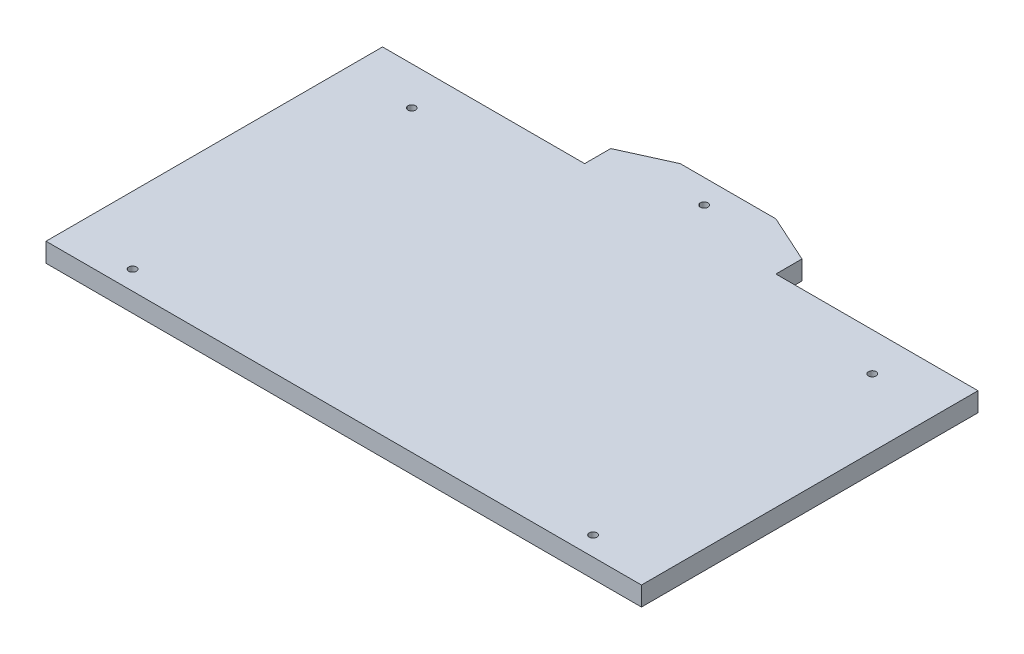
ISO-10303-21;
HEADER;
FILE_DESCRIPTION(('STEP AP214'),'2;1');
FILE_NAME('part.step','',(''),(''),'','','');
FILE_SCHEMA(('AUTOMOTIVE_DESIGN { 1 0 10303 214 1 1 1 1 }'));
ENDSEC;
DATA;
#1=APPLICATION_CONTEXT('core data for automotive mechanical design processes');
#2=APPLICATION_PROTOCOL_DEFINITION('international standard','automotive_design',2000,#1);
#3=PRODUCT_CONTEXT('',#1,'mechanical');
#4=PRODUCT('Part','Part','',(#3));
#5=PRODUCT_RELATED_PRODUCT_CATEGORY('part','',(#4));
#6=PRODUCT_DEFINITION_FORMATION('','',#4);
#7=PRODUCT_DEFINITION_CONTEXT('part definition',#1,'design');
#8=PRODUCT_DEFINITION('design','',#6,#7);
#9=PRODUCT_DEFINITION_SHAPE('','',#8);
#10=(LENGTH_UNIT() NAMED_UNIT(*) SI_UNIT(.MILLI.,.METRE.));
#11=(NAMED_UNIT(*) PLANE_ANGLE_UNIT() SI_UNIT($,.RADIAN.));
#12=(NAMED_UNIT(*) SI_UNIT($,.STERADIAN.) SOLID_ANGLE_UNIT());
#13=UNCERTAINTY_MEASURE_WITH_UNIT(LENGTH_MEASURE(1.E-05),#10,'distance_accuracy_value','');
#14=(GEOMETRIC_REPRESENTATION_CONTEXT(3) GLOBAL_UNCERTAINTY_ASSIGNED_CONTEXT((#13)) GLOBAL_UNIT_ASSIGNED_CONTEXT((#10,
#11,#12)) REPRESENTATION_CONTEXT('',''));
#15=CARTESIAN_POINT('',(0.,0.,0.));
#16=DIRECTION('',(0.,0.,1.));
#17=DIRECTION('',(1.,0.,0.));
#18=AXIS2_PLACEMENT_3D('',#15,#16,#17);
#19=CARTESIAN_POINT('',(0.,5.,-44.));
#20=DIRECTION('',(0.,0.,1.));
#21=DIRECTION('',(1.,0.,0.));
#22=AXIS2_PLACEMENT_3D('',#19,#20,#21);
#23=PLANE('',#22);
#24=DIRECTION('',(0.,1.,0.));
#25=VECTOR('',#24,1.);
#26=CARTESIAN_POINT('',(-23.8283042472908,-51.537589944117,-44.));
#27=LINE('',#26,#25);
#28=CARTESIAN_POINT('',(-23.8283042472908,0.,-44.));
#29=VERTEX_POINT('',#28);
#30=CARTESIAN_POINT('',(-23.8283042472908,5.,-44.));
#31=VERTEX_POINT('',#30);
#32=EDGE_CURVE('E74',#29,#31,#27,.T.);
#33=ORIENTED_EDGE('',*,*,#32,.F.);
#34=DIRECTION('',(-1.,0.,0.));
#35=VECTOR('',#34,1.);
#36=CARTESIAN_POINT('',(0.,0.,-44.));
#37=LINE('',#36,#35);
#38=CARTESIAN_POINT('',(-76.6797078460986,0.,-44.));
#39=VERTEX_POINT('',#38);
#40=EDGE_CURVE('E212',#29,#39,#37,.T.);
#41=ORIENTED_EDGE('',*,*,#40,.T.);
#42=DIRECTION('',(0.,-1.,0.));
#43=VECTOR('',#42,1.);
#44=CARTESIAN_POINT('',(-76.6797078460986,5.,-44.));
#45=LINE('',#44,#43);
#46=CARTESIAN_POINT('',(-76.6797078460986,5.,-44.));
#47=VERTEX_POINT('',#46);
#48=EDGE_CURVE('E59',#47,#39,#45,.T.);
#49=ORIENTED_EDGE('',*,*,#48,.F.);
#50=DIRECTION('',(-1.,0.,0.));
#51=VECTOR('',#50,1.);
#52=CARTESIAN_POINT('',(0.,5.,-44.));
#53=LINE('',#52,#51);
#54=EDGE_CURVE('E198',#31,#47,#53,.T.);
#55=ORIENTED_EDGE('',*,*,#54,.F.);
#56=EDGE_LOOP('',(#33,#41,#49,#55));
#57=FACE_BOUND('',#56,.T.);
#58=ADVANCED_FACE('F50',(#57),#23,.F.);
#59=CARTESIAN_POINT('',(79.023099351517,5.,0.));
#60=DIRECTION('',(1.,0.,0.));
#61=DIRECTION('',(0.,0.,-1.));
#62=AXIS2_PLACEMENT_3D('',#59,#60,#61);
#63=PLANE('',#62);
#64=DIRECTION('',(0.,0.,1.));
#65=VECTOR('',#64,1.);
#66=CARTESIAN_POINT('',(79.023099351517,0.,0.));
#67=LINE('',#66,#65);
#68=CARTESIAN_POINT('',(79.023099351517,0.,-44.));
#69=VERTEX_POINT('',#68);
#70=CARTESIAN_POINT('',(79.023099351517,0.,44.));
#71=VERTEX_POINT('',#70);
#72=EDGE_CURVE('E192',#69,#71,#67,.T.);
#73=ORIENTED_EDGE('',*,*,#72,.F.);
#74=DIRECTION('',(0.,-1.,0.));
#75=VECTOR('',#74,1.);
#76=CARTESIAN_POINT('',(79.023099351517,5.,-44.));
#77=LINE('',#76,#75);
#78=CARTESIAN_POINT('',(79.023099351517,5.,-44.));
#79=VERTEX_POINT('',#78);
#80=EDGE_CURVE('E11',#79,#69,#77,.T.);
#81=ORIENTED_EDGE('',*,*,#80,.F.);
#82=DIRECTION('',(0.,0.,1.));
#83=VECTOR('',#82,1.);
#84=CARTESIAN_POINT('',(79.023099351517,5.,0.));
#85=LINE('',#84,#83);
#86=CARTESIAN_POINT('',(79.023099351517,5.,44.));
#87=VERTEX_POINT('',#86);
#88=EDGE_CURVE('E194',#79,#87,#85,.T.);
#89=ORIENTED_EDGE('',*,*,#88,.T.);
#90=DIRECTION('',(0.,-1.,0.));
#91=VECTOR('',#90,1.);
#92=CARTESIAN_POINT('',(79.023099351517,5.,44.));
#93=LINE('',#92,#91);
#94=EDGE_CURVE('E208',#87,#71,#93,.T.);
#95=ORIENTED_EDGE('',*,*,#94,.T.);
#96=EDGE_LOOP('',(#73,#81,#89,#95));
#97=FACE_BOUND('',#96,.T.);
#98=ADVANCED_FACE('F52',(#97),#63,.T.);
#99=CARTESIAN_POINT('',(26.1716957527092,0.,-44.));
#100=VERTEX_POINT('',#99);
#101=EDGE_CURVE('E213',#69,#100,#37,.T.);
#102=ORIENTED_EDGE('',*,*,#101,.T.);
#103=DIRECTION('',(0.,1.,0.));
#104=VECTOR('',#103,1.);
#105=CARTESIAN_POINT('',(26.1716957527092,-51.537589944117,-44.));
#106=LINE('',#105,#104);
#107=CARTESIAN_POINT('',(26.1716957527092,5.,-44.));
#108=VERTEX_POINT('',#107);
#109=EDGE_CURVE('E66',#100,#108,#106,.T.);
#110=ORIENTED_EDGE('',*,*,#109,.T.);
#111=EDGE_CURVE('E155',#79,#108,#53,.T.);
#112=ORIENTED_EDGE('',*,*,#111,.F.);
#113=ORIENTED_EDGE('',*,*,#80,.T.);
#114=EDGE_LOOP('',(#102,#110,#112,#113));
#115=FACE_BOUND('',#114,.T.);
#116=ADVANCED_FACE('F332',(#115),#23,.F.);
#117=CARTESIAN_POINT('',(-76.6797078460986,5.,0.));
#118=DIRECTION('',(1.,0.,0.));
#119=DIRECTION('',(0.,0.,-1.));
#120=AXIS2_PLACEMENT_3D('',#117,#118,#119);
#121=PLANE('',#120);
#122=DIRECTION('',(0.,0.,1.));
#123=VECTOR('',#122,1.);
#124=CARTESIAN_POINT('',(-76.6797078460986,0.,0.));
#125=LINE('',#124,#123);
#126=CARTESIAN_POINT('',(-76.6797078460986,0.,44.));
#127=VERTEX_POINT('',#126);
#128=EDGE_CURVE('E216',#39,#127,#125,.T.);
#129=ORIENTED_EDGE('',*,*,#128,.T.);
#130=DIRECTION('',(0.,-1.,0.));
#131=VECTOR('',#130,1.);
#132=CARTESIAN_POINT('',(-76.6797078460986,5.,44.));
#133=LINE('',#132,#131);
#134=CARTESIAN_POINT('',(-76.6797078460986,5.,44.));
#135=VERTEX_POINT('',#134);
#136=EDGE_CURVE('E224',#135,#127,#133,.T.);
#137=ORIENTED_EDGE('',*,*,#136,.F.);
#138=DIRECTION('',(0.,0.,1.));
#139=VECTOR('',#138,1.);
#140=CARTESIAN_POINT('',(-76.6797078460986,5.,0.));
#141=LINE('',#140,#139);
#142=EDGE_CURVE('E202',#47,#135,#141,.T.);
#143=ORIENTED_EDGE('',*,*,#142,.F.);
#144=ORIENTED_EDGE('',*,*,#48,.T.);
#145=EDGE_LOOP('',(#129,#137,#143,#144));
#146=FACE_BOUND('',#145,.T.);
#147=ADVANCED_FACE('F234',(#146),#121,.F.);
#148=CARTESIAN_POINT('',(0.,5.,44.));
#149=DIRECTION('',(0.,0.,-1.));
#150=DIRECTION('',(-1.,0.,0.));
#151=AXIS2_PLACEMENT_3D('',#148,#149,#150);
#152=PLANE('',#151);
#153=DIRECTION('',(1.,0.,0.));
#154=VECTOR('',#153,1.);
#155=CARTESIAN_POINT('',(0.,0.,44.));
#156=LINE('',#155,#154);
#157=EDGE_CURVE('E199',#127,#71,#156,.T.);
#158=ORIENTED_EDGE('',*,*,#157,.T.);
#159=ORIENTED_EDGE('',*,*,#94,.F.);
#160=DIRECTION('',(1.,0.,0.));
#161=VECTOR('',#160,1.);
#162=CARTESIAN_POINT('',(0.,5.,44.));
#163=LINE('',#162,#161);
#164=EDGE_CURVE('E205',#135,#87,#163,.T.);
#165=ORIENTED_EDGE('',*,*,#164,.F.);
#166=ORIENTED_EDGE('',*,*,#136,.T.);
#167=EDGE_LOOP('',(#158,#159,#165,#166));
#168=FACE_BOUND('',#167,.T.);
#169=ADVANCED_FACE('F245',(#168),#152,.F.);
#170=CARTESIAN_POINT('',(0.,5.,0.));
#171=DIRECTION('',(0.,1.,0.));
#172=DIRECTION('',(0.,0.,1.));
#173=AXIS2_PLACEMENT_3D('',#170,#171,#172);
#174=PLANE('',#173);
#175=ORIENTED_EDGE('',*,*,#88,.F.);
#176=ORIENTED_EDGE('',*,*,#111,.T.);
#177=DIRECTION('',(0.,0.,-1.));
#178=VECTOR('',#177,1.);
#179=CARTESIAN_POINT('',(26.1716957527092,5.,-44.));
#180=LINE('',#179,#178);
#181=CARTESIAN_POINT('',(26.1716957527092,5.,-50.823606938333));
#182=VERTEX_POINT('',#181);
#183=EDGE_CURVE('E133',#108,#182,#180,.T.);
#184=ORIENTED_EDGE('',*,*,#183,.T.);
#185=DIRECTION('',(-0.910654396943775,0.,-0.413168935578379));
#186=VECTOR('',#185,1.);
#187=CARTESIAN_POINT('',(26.1716957527092,5.,-50.823606938333));
#188=LINE('',#187,#186);
#189=CARTESIAN_POINT('',(13.6716957527092,5.,-56.4949260601234));
#190=VERTEX_POINT('',#189);
#191=EDGE_CURVE('E143',#182,#190,#188,.T.);
#192=ORIENTED_EDGE('',*,*,#191,.T.);
#193=DIRECTION('',(-1.,0.,0.));
#194=VECTOR('',#193,1.);
#195=CARTESIAN_POINT('',(13.6716957527092,5.,-56.4949260601234));
#196=LINE('',#195,#194);
#197=CARTESIAN_POINT('',(-11.3283042472908,5.,-56.4949260601235));
#198=VERTEX_POINT('',#197);
#199=EDGE_CURVE('E150',#190,#198,#196,.T.);
#200=ORIENTED_EDGE('',*,*,#199,.T.);
#201=DIRECTION('',(-0.910654396943774,0.,0.41316893557838));
#202=VECTOR('',#201,1.);
#203=CARTESIAN_POINT('',(-11.3283042472908,5.,-56.4949260601235));
#204=LINE('',#203,#202);
#205=CARTESIAN_POINT('',(-23.8283042472908,5.,-50.823606938333));
#206=VERTEX_POINT('',#205);
#207=EDGE_CURVE('E168',#198,#206,#204,.T.);
#208=ORIENTED_EDGE('',*,*,#207,.T.);
#209=DIRECTION('',(0.,0.,1.));
#210=VECTOR('',#209,1.);
#211=CARTESIAN_POINT('',(-23.8283042472908,5.,-50.823606938333));
#212=LINE('',#211,#210);
#213=EDGE_CURVE('E140',#206,#31,#212,.T.);
#214=ORIENTED_EDGE('',*,*,#213,.T.);
#215=ORIENTED_EDGE('',*,*,#54,.T.);
#216=ORIENTED_EDGE('',*,*,#142,.T.);
#217=ORIENTED_EDGE('',*,*,#164,.T.);
#218=EDGE_LOOP('',(#175,#176,#184,#192,#200,#208,#214,#215,#216,#217));
#219=FACE_BOUND('',#218,.T.);
#220=CARTESIAN_POINT('',(1.17169575270918,5.,-50.2474630300617));
#221=DIRECTION('',(0.,1.,0.));
#222=DIRECTION('',(0.,0.,1.));
#223=AXIS2_PLACEMENT_3D('',#220,#221,#222);
#224=CIRCLE('',#223,1.);
#225=CARTESIAN_POINT('',(1.17169575270918,5.,-49.2474630300617));
#226=VERTEX_POINT('',#225);
#227=EDGE_CURVE('E157',#226,#226,#224,.T.);
#228=ORIENTED_EDGE('',*,*,#227,.F.);
#229=EDGE_LOOP('',(#228));
#230=FACE_BOUND('',#229,.T.);
#231=CARTESIAN_POINT('',(61.3854570382798,5.,-34.));
#232=DIRECTION('',(0.,1.,0.));
#233=DIRECTION('',(0.,0.,1.));
#234=AXIS2_PLACEMENT_3D('',#231,#232,#233);
#235=CIRCLE('',#234,1.);
#236=CARTESIAN_POINT('',(61.3854570382798,5.,-33.));
#237=VERTEX_POINT('',#236);
#238=EDGE_CURVE('E290',#237,#237,#235,.T.);
#239=ORIENTED_EDGE('',*,*,#238,.F.);
#240=EDGE_LOOP('',(#239));
#241=FACE_BOUND('',#240,.T.);
#242=CARTESIAN_POINT('',(61.3854570382798,5.,39.));
#243=DIRECTION('',(0.,1.,0.));
#244=DIRECTION('',(0.,0.,1.));
#245=AXIS2_PLACEMENT_3D('',#242,#243,#244);
#246=CIRCLE('',#245,1.);
#247=CARTESIAN_POINT('',(61.3854570382798,5.,40.));
#248=VERTEX_POINT('',#247);
#249=EDGE_CURVE('E298',#248,#248,#246,.T.);
#250=ORIENTED_EDGE('',*,*,#249,.F.);
#251=EDGE_LOOP('',(#250));
#252=FACE_BOUND('',#251,.T.);
#253=CARTESIAN_POINT('',(-59.0420655328614,5.,39.));
#254=DIRECTION('',(0.,1.,0.));
#255=DIRECTION('',(0.,0.,1.));
#256=AXIS2_PLACEMENT_3D('',#253,#254,#255);
#257=CIRCLE('',#256,0.999999999999994);
#258=CARTESIAN_POINT('',(-59.0420655328614,5.,40.));
#259=VERTEX_POINT('',#258);
#260=EDGE_CURVE('E306',#259,#259,#257,.T.);
#261=ORIENTED_EDGE('',*,*,#260,.F.);
#262=EDGE_LOOP('',(#261));
#263=FACE_BOUND('',#262,.T.);
#264=CARTESIAN_POINT('',(-59.0420655328614,5.,-34.));
#265=DIRECTION('',(0.,1.,0.));
#266=DIRECTION('',(0.,0.,1.));
#267=AXIS2_PLACEMENT_3D('',#264,#265,#266);
#268=CIRCLE('',#267,0.999999999999994);
#269=CARTESIAN_POINT('',(-59.0420655328614,5.,-33.));
#270=VERTEX_POINT('',#269);
#271=EDGE_CURVE('E314',#270,#270,#268,.T.);
#272=ORIENTED_EDGE('',*,*,#271,.F.);
#273=EDGE_LOOP('',(#272));
#274=FACE_BOUND('',#273,.T.);
#275=ADVANCED_FACE('F153',(#219,#230,#241,#252,#263,#274),#174,.T.);
#276=CARTESIAN_POINT('',(0.,0.,0.));
#277=DIRECTION('',(0.,1.,0.));
#278=DIRECTION('',(0.,0.,1.));
#279=AXIS2_PLACEMENT_3D('',#276,#277,#278);
#280=PLANE('',#279);
#281=ORIENTED_EDGE('',*,*,#72,.T.);
#282=ORIENTED_EDGE('',*,*,#157,.F.);
#283=ORIENTED_EDGE('',*,*,#128,.F.);
#284=ORIENTED_EDGE('',*,*,#40,.F.);
#285=DIRECTION('',(0.,0.,-1.));
#286=VECTOR('',#285,1.);
#287=CARTESIAN_POINT('',(-23.8283042472908,0.,-50.823606938333));
#288=LINE('',#287,#286);
#289=CARTESIAN_POINT('',(-23.8283042472908,0.,-50.823606938333));
#290=VERTEX_POINT('',#289);
#291=EDGE_CURVE('E265',#29,#290,#288,.T.);
#292=ORIENTED_EDGE('',*,*,#291,.T.);
#293=DIRECTION('',(0.910654396943774,0.,-0.41316893557838));
#294=VECTOR('',#293,1.);
#295=CARTESIAN_POINT('',(-11.3283042472908,0.,-56.4949260601235));
#296=LINE('',#295,#294);
#297=CARTESIAN_POINT('',(-11.3283042472908,0.,-56.4949260601235));
#298=VERTEX_POINT('',#297);
#299=EDGE_CURVE('E268',#290,#298,#296,.T.);
#300=ORIENTED_EDGE('',*,*,#299,.T.);
#301=DIRECTION('',(1.,0.,0.));
#302=VECTOR('',#301,1.);
#303=CARTESIAN_POINT('',(13.6716957527092,0.,-56.4949260601234));
#304=LINE('',#303,#302);
#305=CARTESIAN_POINT('',(13.6716957527092,0.,-56.4949260601234));
#306=VERTEX_POINT('',#305);
#307=EDGE_CURVE('E177',#298,#306,#304,.T.);
#308=ORIENTED_EDGE('',*,*,#307,.T.);
#309=DIRECTION('',(0.910654396943775,0.,0.413168935578379));
#310=VECTOR('',#309,1.);
#311=CARTESIAN_POINT('',(26.1716957527092,0.,-50.823606938333));
#312=LINE('',#311,#310);
#313=CARTESIAN_POINT('',(26.1716957527092,0.,-50.823606938333));
#314=VERTEX_POINT('',#313);
#315=EDGE_CURVE('E193',#306,#314,#312,.T.);
#316=ORIENTED_EDGE('',*,*,#315,.T.);
#317=DIRECTION('',(0.,0.,1.));
#318=VECTOR('',#317,1.);
#319=CARTESIAN_POINT('',(26.1716957527092,0.,-44.));
#320=LINE('',#319,#318);
#321=EDGE_CURVE('E135',#314,#100,#320,.T.);
#322=ORIENTED_EDGE('',*,*,#321,.T.);
#323=ORIENTED_EDGE('',*,*,#101,.F.);
#324=EDGE_LOOP('',(#281,#282,#283,#284,#292,#300,#308,#316,#322,#323));
#325=FACE_BOUND('',#324,.T.);
#326=CARTESIAN_POINT('',(1.17169575270918,0.,-50.2474630300617));
#327=DIRECTION('',(0.,1.,0.));
#328=DIRECTION('',(0.,0.,1.));
#329=AXIS2_PLACEMENT_3D('',#326,#327,#328);
#330=CIRCLE('',#329,1.);
#331=CARTESIAN_POINT('',(1.17169575270918,0.,-49.2474630300617));
#332=VERTEX_POINT('',#331);
#333=EDGE_CURVE('E188',#332,#332,#330,.F.);
#334=ORIENTED_EDGE('',*,*,#333,.F.);
#335=EDGE_LOOP('',(#334));
#336=FACE_BOUND('',#335,.T.);
#337=CARTESIAN_POINT('',(61.3854570382798,0.,-34.));
#338=DIRECTION('',(0.,1.,0.));
#339=DIRECTION('',(0.,0.,1.));
#340=AXIS2_PLACEMENT_3D('',#337,#338,#339);
#341=CIRCLE('',#340,1.);
#342=CARTESIAN_POINT('',(61.3854570382798,0.,-33.));
#343=VERTEX_POINT('',#342);
#344=EDGE_CURVE('E162',#343,#343,#341,.F.);
#345=ORIENTED_EDGE('',*,*,#344,.F.);
#346=EDGE_LOOP('',(#345));
#347=FACE_BOUND('',#346,.T.);
#348=CARTESIAN_POINT('',(61.3854570382798,0.,39.));
#349=DIRECTION('',(0.,1.,0.));
#350=DIRECTION('',(0.,0.,1.));
#351=AXIS2_PLACEMENT_3D('',#348,#349,#350);
#352=CIRCLE('',#351,1.);
#353=CARTESIAN_POINT('',(61.3854570382798,0.,40.));
#354=VERTEX_POINT('',#353);
#355=EDGE_CURVE('E294',#354,#354,#352,.F.);
#356=ORIENTED_EDGE('',*,*,#355,.F.);
#357=EDGE_LOOP('',(#356));
#358=FACE_BOUND('',#357,.T.);
#359=CARTESIAN_POINT('',(-59.0420655328614,0.,39.));
#360=DIRECTION('',(0.,1.,0.));
#361=DIRECTION('',(0.,0.,1.));
#362=AXIS2_PLACEMENT_3D('',#359,#360,#361);
#363=CIRCLE('',#362,0.999999999999994);
#364=CARTESIAN_POINT('',(-59.0420655328614,0.,40.));
#365=VERTEX_POINT('',#364);
#366=EDGE_CURVE('E302',#365,#365,#363,.F.);
#367=ORIENTED_EDGE('',*,*,#366,.F.);
#368=EDGE_LOOP('',(#367));
#369=FACE_BOUND('',#368,.T.);
#370=CARTESIAN_POINT('',(-59.0420655328614,0.,-34.));
#371=DIRECTION('',(0.,1.,0.));
#372=DIRECTION('',(0.,0.,1.));
#373=AXIS2_PLACEMENT_3D('',#370,#371,#372);
#374=CIRCLE('',#373,0.999999999999994);
#375=CARTESIAN_POINT('',(-59.0420655328614,0.,-33.));
#376=VERTEX_POINT('',#375);
#377=EDGE_CURVE('E310',#376,#376,#374,.F.);
#378=ORIENTED_EDGE('',*,*,#377,.F.);
#379=EDGE_LOOP('',(#378));
#380=FACE_BOUND('',#379,.T.);
#381=ADVANCED_FACE('F238',(#325,#336,#347,#358,#369,#380),#280,.F.);
#382=CARTESIAN_POINT('',(26.1716957527092,-51.537589944117,-50.823606938333));
#383=DIRECTION('',(0.413168935578379,0.,-0.910654396943774));
#384=DIRECTION('',(-0.910654396943775,0.,-0.413168935578379));
#385=AXIS2_PLACEMENT_3D('',#382,#383,#384);
#386=PLANE('',#385);
#387=ORIENTED_EDGE('',*,*,#315,.F.);
#388=DIRECTION('',(0.,1.,0.));
#389=VECTOR('',#388,1.);
#390=CARTESIAN_POINT('',(13.6716957527092,-51.537589944117,-56.4949260601234));
#391=LINE('',#390,#389);
#392=EDGE_CURVE('E139',#306,#190,#391,.T.);
#393=ORIENTED_EDGE('',*,*,#392,.T.);
#394=ORIENTED_EDGE('',*,*,#191,.F.);
#395=DIRECTION('',(0.,1.,0.));
#396=VECTOR('',#395,1.);
#397=CARTESIAN_POINT('',(26.1716957527092,-51.537589944117,-50.823606938333));
#398=LINE('',#397,#396);
#399=EDGE_CURVE('E129',#314,#182,#398,.T.);
#400=ORIENTED_EDGE('',*,*,#399,.F.);
#401=EDGE_LOOP('',(#387,#393,#394,#400));
#402=FACE_BOUND('',#401,.T.);
#403=ADVANCED_FACE('F144',(#402),#386,.T.);
#404=CARTESIAN_POINT('',(13.6716957527092,-51.537589944117,-56.4949260601234));
#405=DIRECTION('',(0.,0.,-1.));
#406=DIRECTION('',(-1.,0.,0.));
#407=AXIS2_PLACEMENT_3D('',#404,#405,#406);
#408=PLANE('',#407);
#409=ORIENTED_EDGE('',*,*,#307,.F.);
#410=DIRECTION('',(0.,1.,0.));
#411=VECTOR('',#410,1.);
#412=CARTESIAN_POINT('',(-11.3283042472908,-51.537589944117,-56.4949260601235));
#413=LINE('',#412,#411);
#414=EDGE_CURVE('E183',#298,#198,#413,.T.);
#415=ORIENTED_EDGE('',*,*,#414,.T.);
#416=ORIENTED_EDGE('',*,*,#199,.F.);
#417=ORIENTED_EDGE('',*,*,#392,.F.);
#418=EDGE_LOOP('',(#409,#415,#416,#417));
#419=FACE_BOUND('',#418,.T.);
#420=ADVANCED_FACE('F367',(#419),#408,.T.);
#421=CARTESIAN_POINT('',(-11.3283042472908,-51.537589944117,-56.4949260601235));
#422=DIRECTION('',(-0.41316893557838,0.,-0.910654396943774));
#423=DIRECTION('',(-0.910654396943774,0.,0.41316893557838));
#424=AXIS2_PLACEMENT_3D('',#421,#422,#423);
#425=PLANE('',#424);
#426=ORIENTED_EDGE('',*,*,#299,.F.);
#427=DIRECTION('',(0.,1.,0.));
#428=VECTOR('',#427,1.);
#429=CARTESIAN_POINT('',(-23.8283042472908,-51.537589944117,-50.823606938333));
#430=LINE('',#429,#428);
#431=EDGE_CURVE('E180',#290,#206,#430,.T.);
#432=ORIENTED_EDGE('',*,*,#431,.T.);
#433=ORIENTED_EDGE('',*,*,#207,.F.);
#434=ORIENTED_EDGE('',*,*,#414,.F.);
#435=EDGE_LOOP('',(#426,#432,#433,#434));
#436=FACE_BOUND('',#435,.T.);
#437=ADVANCED_FACE('F376',(#436),#425,.T.);
#438=CARTESIAN_POINT('',(-23.8283042472908,-51.537589944117,-50.823606938333));
#439=DIRECTION('',(-1.,0.,0.));
#440=DIRECTION('',(0.,0.,1.));
#441=AXIS2_PLACEMENT_3D('',#438,#439,#440);
#442=PLANE('',#441);
#443=ORIENTED_EDGE('',*,*,#291,.F.);
#444=ORIENTED_EDGE('',*,*,#32,.T.);
#445=ORIENTED_EDGE('',*,*,#213,.F.);
#446=ORIENTED_EDGE('',*,*,#431,.F.);
#447=EDGE_LOOP('',(#443,#444,#445,#446));
#448=FACE_BOUND('',#447,.T.);
#449=ADVANCED_FACE('F386',(#448),#442,.T.);
#450=CARTESIAN_POINT('',(26.1716957527092,-51.537589944117,-44.));
#451=DIRECTION('',(1.,0.,0.));
#452=DIRECTION('',(0.,0.,-1.));
#453=AXIS2_PLACEMENT_3D('',#450,#451,#452);
#454=PLANE('',#453);
#455=ORIENTED_EDGE('',*,*,#321,.F.);
#456=ORIENTED_EDGE('',*,*,#399,.T.);
#457=ORIENTED_EDGE('',*,*,#183,.F.);
#458=ORIENTED_EDGE('',*,*,#109,.F.);
#459=EDGE_LOOP('',(#455,#456,#457,#458));
#460=FACE_BOUND('',#459,.T.);
#461=ADVANCED_FACE('F131',(#460),#454,.T.);
#462=CARTESIAN_POINT('',(1.17169575270918,-51.537589944117,-50.2474630300617));
#463=DIRECTION('',(0.,1.,0.));
#464=DIRECTION('',(0.,0.,1.));
#465=AXIS2_PLACEMENT_3D('',#462,#463,#464);
#466=CYLINDRICAL_SURFACE('',#465,1.);
#467=ORIENTED_EDGE('',*,*,#333,.T.);
#468=EDGE_LOOP('',(#467));
#469=FACE_BOUND('',#468,.T.);
#470=ORIENTED_EDGE('',*,*,#227,.T.);
#471=EDGE_LOOP('',(#470));
#472=FACE_BOUND('',#471,.T.);
#473=ADVANCED_FACE('F405',(#469,#472),#466,.F.);
#474=CARTESIAN_POINT('',(61.3854570382798,-4.24264068711927,-34.));
#475=DIRECTION('',(0.,1.,0.));
#476=DIRECTION('',(0.,0.,1.));
#477=AXIS2_PLACEMENT_3D('',#474,#475,#476);
#478=CYLINDRICAL_SURFACE('',#477,1.);
#479=ORIENTED_EDGE('',*,*,#344,.T.);
#480=EDGE_LOOP('',(#479));
#481=FACE_BOUND('',#480,.T.);
#482=ORIENTED_EDGE('',*,*,#238,.T.);
#483=EDGE_LOOP('',(#482));
#484=FACE_BOUND('',#483,.T.);
#485=ADVANCED_FACE('F413',(#481,#484),#478,.F.);
#486=CARTESIAN_POINT('',(61.3854570382798,-4.24264068711927,39.));
#487=DIRECTION('',(0.,1.,0.));
#488=DIRECTION('',(0.,0.,1.));
#489=AXIS2_PLACEMENT_3D('',#486,#487,#488);
#490=CYLINDRICAL_SURFACE('',#489,1.);
#491=ORIENTED_EDGE('',*,*,#355,.T.);
#492=EDGE_LOOP('',(#491));
#493=FACE_BOUND('',#492,.T.);
#494=ORIENTED_EDGE('',*,*,#249,.T.);
#495=EDGE_LOOP('',(#494));
#496=FACE_BOUND('',#495,.T.);
#497=ADVANCED_FACE('F423',(#493,#496),#490,.F.);
#498=CARTESIAN_POINT('',(-59.0420655328614,-4.24264068711927,39.));
#499=DIRECTION('',(0.,1.,0.));
#500=DIRECTION('',(0.,0.,1.));
#501=AXIS2_PLACEMENT_3D('',#498,#499,#500);
#502=CYLINDRICAL_SURFACE('',#501,0.999999999999994);
#503=ORIENTED_EDGE('',*,*,#366,.T.);
#504=EDGE_LOOP('',(#503));
#505=FACE_BOUND('',#504,.T.);
#506=ORIENTED_EDGE('',*,*,#260,.T.);
#507=EDGE_LOOP('',(#506));
#508=FACE_BOUND('',#507,.T.);
#509=ADVANCED_FACE('F433',(#505,#508),#502,.F.);
#510=CARTESIAN_POINT('',(-59.0420655328614,-4.24264068711927,-34.));
#511=DIRECTION('',(0.,1.,0.));
#512=DIRECTION('',(0.,0.,1.));
#513=AXIS2_PLACEMENT_3D('',#510,#511,#512);
#514=CYLINDRICAL_SURFACE('',#513,0.999999999999994);
#515=ORIENTED_EDGE('',*,*,#377,.T.);
#516=EDGE_LOOP('',(#515));
#517=FACE_BOUND('',#516,.T.);
#518=ORIENTED_EDGE('',*,*,#271,.T.);
#519=EDGE_LOOP('',(#518));
#520=FACE_BOUND('',#519,.T.);
#521=ADVANCED_FACE('F320',(#517,#520),#514,.F.);
#522=CLOSED_SHELL('',(#58,#98,#116,#147,#169,#275,#381,#403,#420,#437,#449,#461,#473,#485,#497,
#509,#521));
#523=MANIFOLD_SOLID_BREP('B2',#522);
#524=ADVANCED_BREP_SHAPE_REPRESENTATION('',(#18,#523),#14);
#525=SHAPE_DEFINITION_REPRESENTATION(#9,#524);
ENDSEC;
END-ISO-10303-21;
